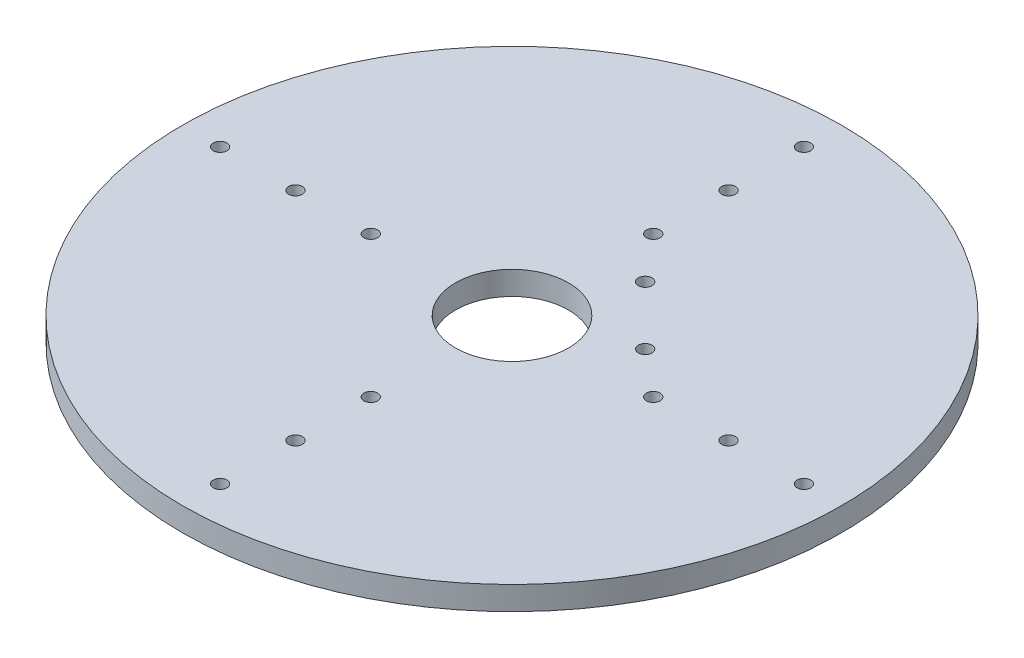
ISO-10303-21;
HEADER;
FILE_DESCRIPTION(('STEP AP214'),'2;1');
FILE_NAME('part.step','',(''),(''),'','','');
FILE_SCHEMA(('AUTOMOTIVE_DESIGN { 1 0 10303 214 1 1 1 1 }'));
ENDSEC;
DATA;
#1=APPLICATION_CONTEXT('core data for automotive mechanical design processes');
#2=APPLICATION_PROTOCOL_DEFINITION('international standard','automotive_design',2000,#1);
#3=PRODUCT_CONTEXT('',#1,'mechanical');
#4=PRODUCT('Part','Part','',(#3));
#5=PRODUCT_RELATED_PRODUCT_CATEGORY('part','',(#4));
#6=PRODUCT_DEFINITION_FORMATION('','',#4);
#7=PRODUCT_DEFINITION_CONTEXT('part definition',#1,'design');
#8=PRODUCT_DEFINITION('design','',#6,#7);
#9=PRODUCT_DEFINITION_SHAPE('','',#8);
#10=(LENGTH_UNIT() NAMED_UNIT(*) SI_UNIT(.MILLI.,.METRE.));
#11=(NAMED_UNIT(*) PLANE_ANGLE_UNIT() SI_UNIT($,.RADIAN.));
#12=(NAMED_UNIT(*) SI_UNIT($,.STERADIAN.) SOLID_ANGLE_UNIT());
#13=UNCERTAINTY_MEASURE_WITH_UNIT(LENGTH_MEASURE(1.E-05),#10,'distance_accuracy_value','');
#14=(GEOMETRIC_REPRESENTATION_CONTEXT(3) GLOBAL_UNCERTAINTY_ASSIGNED_CONTEXT((#13)) GLOBAL_UNIT_ASSIGNED_CONTEXT((#10,
#11,#12)) REPRESENTATION_CONTEXT('',''));
#15=CARTESIAN_POINT('',(0.,0.,0.));
#16=DIRECTION('',(0.,0.,1.));
#17=DIRECTION('',(1.,0.,0.));
#18=AXIS2_PLACEMENT_3D('',#15,#16,#17);
#19=CARTESIAN_POINT('',(0.,2.5,0.));
#20=DIRECTION('',(0.,1.,0.));
#21=DIRECTION('',(0.,0.,1.));
#22=AXIS2_PLACEMENT_3D('',#19,#20,#21);
#23=PLANE('',#22);
#24=CARTESIAN_POINT('',(0.,2.5,46.0000000000003));
#25=DIRECTION('',(0.,1.,0.));
#26=DIRECTION('',(0.,0.,1.));
#27=AXIS2_PLACEMENT_3D('',#24,#25,#26);
#28=CIRCLE('',#27,1.44999999999995);
#29=CARTESIAN_POINT('',(0.,2.5,47.4500000000002));
#30=VERTEX_POINT('',#29);
#31=EDGE_CURVE('E120',#30,#30,#28,.T.);
#32=ORIENTED_EDGE('',*,*,#31,.F.);
#33=EDGE_LOOP('',(#32));
#34=FACE_BOUND('',#33,.T.);
#35=CARTESIAN_POINT('',(-61.9999999999998,2.5,0.));
#36=DIRECTION('',(0.,1.,0.));
#37=DIRECTION('',(0.,0.,1.));
#38=AXIS2_PLACEMENT_3D('',#35,#36,#37);
#39=CIRCLE('',#38,1.44999999999995);
#40=CARTESIAN_POINT('',(-61.9999999999998,2.5,1.44999999999995));
#41=VERTEX_POINT('',#40);
#42=EDGE_CURVE('E108',#41,#41,#39,.T.);
#43=ORIENTED_EDGE('',*,*,#42,.F.);
#44=EDGE_LOOP('',(#43));
#45=FACE_BOUND('',#44,.T.);
#46=CARTESIAN_POINT('',(-30.,2.5,0.));
#47=DIRECTION('',(0.,1.,0.));
#48=DIRECTION('',(0.,0.,1.));
#49=AXIS2_PLACEMENT_3D('',#46,#47,#48);
#50=CIRCLE('',#49,1.44999999999995);
#51=CARTESIAN_POINT('',(-30.,2.5,1.44999999999995));
#52=VERTEX_POINT('',#51);
#53=EDGE_CURVE('E96',#52,#52,#50,.T.);
#54=ORIENTED_EDGE('',*,*,#53,.F.);
#55=EDGE_LOOP('',(#54));
#56=FACE_BOUND('',#55,.T.);
#57=CARTESIAN_POINT('',(1.11022302462516E-12,2.5,-45.9999999999998));
#58=DIRECTION('',(0.,1.,0.));
#59=DIRECTION('',(0.,0.,1.));
#60=AXIS2_PLACEMENT_3D('',#57,#58,#59);
#61=CIRCLE('',#60,1.44999999999995);
#62=CARTESIAN_POINT('',(1.11022302462516E-12,2.5,-44.5499999999999));
#63=VERTEX_POINT('',#62);
#64=EDGE_CURVE('E84',#63,#63,#61,.T.);
#65=ORIENTED_EDGE('',*,*,#64,.F.);
#66=EDGE_LOOP('',(#65));
#67=FACE_BOUND('',#66,.T.);
#68=CARTESIAN_POINT('',(62.0000000000001,2.5,0.));
#69=DIRECTION('',(0.,1.,0.));
#70=DIRECTION('',(0.,0.,1.));
#71=AXIS2_PLACEMENT_3D('',#68,#69,#70);
#72=CIRCLE('',#71,1.44999999999995);
#73=CARTESIAN_POINT('',(62.0000000000001,2.5,1.44999999999995));
#74=VERTEX_POINT('',#73);
#75=EDGE_CURVE('E72',#74,#74,#72,.T.);
#76=ORIENTED_EDGE('',*,*,#75,.F.);
#77=EDGE_LOOP('',(#76));
#78=FACE_BOUND('',#77,.T.);
#79=CARTESIAN_POINT('',(30.,2.5,0.));
#80=DIRECTION('',(0.,1.,0.));
#81=DIRECTION('',(0.,0.,1.));
#82=AXIS2_PLACEMENT_3D('',#79,#80,#81);
#83=CIRCLE('',#82,1.44999999999995);
#84=CARTESIAN_POINT('',(30.,2.5,1.44999999999995));
#85=VERTEX_POINT('',#84);
#86=EDGE_CURVE('E60',#85,#85,#83,.T.);
#87=ORIENTED_EDGE('',*,*,#86,.F.);
#88=EDGE_LOOP('',(#87));
#89=FACE_BOUND('',#88,.T.);
#90=CARTESIAN_POINT('',(20.329319959113,2.5,-7.95495128834922));
#91=DIRECTION('',(0.,1.,0.));
#92=DIRECTION('',(0.,0.,1.));
#93=AXIS2_PLACEMENT_3D('',#90,#91,#92);
#94=CIRCLE('',#93,1.44999999999995);
#95=CARTESIAN_POINT('',(20.329319959113,2.5,-6.50495128834927));
#96=VERTEX_POINT('',#95);
#97=EDGE_CURVE('E48',#96,#96,#94,.T.);
#98=ORIENTED_EDGE('',*,*,#97,.F.);
#99=EDGE_LOOP('',(#98));
#100=FACE_BOUND('',#99,.T.);
#101=CARTESIAN_POINT('',(0.,2.5,0.));
#102=DIRECTION('',(0.,1.,0.));
#103=DIRECTION('',(0.,0.,1.));
#104=AXIS2_PLACEMENT_3D('',#101,#102,#103);
#105=CIRCLE('',#104,70.0000000000001);
#106=CARTESIAN_POINT('',(0.,2.5,70.0000000000001));
#107=VERTEX_POINT('',#106);
#108=EDGE_CURVE('E10',#107,#107,#105,.T.);
#109=ORIENTED_EDGE('',*,*,#108,.T.);
#110=EDGE_LOOP('',(#109));
#111=FACE_BOUND('',#110,.T.);
#112=CARTESIAN_POINT('',(7.954951288349,2.5,-20.3293199591119));
#113=DIRECTION('',(0.,1.,0.));
#114=DIRECTION('',(0.,0.,1.));
#115=AXIS2_PLACEMENT_3D('',#112,#113,#114);
#116=CIRCLE('',#115,1.44999999999995);
#117=CARTESIAN_POINT('',(7.954951288349,2.5,-18.879319959112));
#118=VERTEX_POINT('',#117);
#119=EDGE_CURVE('E43',#118,#118,#116,.T.);
#120=ORIENTED_EDGE('',*,*,#119,.F.);
#121=EDGE_LOOP('',(#120));
#122=FACE_BOUND('',#121,.T.);
#123=CARTESIAN_POINT('',(0.,2.5,0.));
#124=DIRECTION('',(0.,1.,0.));
#125=DIRECTION('',(0.,0.,1.));
#126=AXIS2_PLACEMENT_3D('',#123,#124,#125);
#127=CIRCLE('',#126,12.);
#128=CARTESIAN_POINT('',(0.,2.5,12.));
#129=VERTEX_POINT('',#128);
#130=EDGE_CURVE('E54',#129,#129,#127,.T.);
#131=ORIENTED_EDGE('',*,*,#130,.F.);
#132=EDGE_LOOP('',(#131));
#133=FACE_BOUND('',#132,.T.);
#134=CARTESIAN_POINT('',(46.,2.5,0.));
#135=DIRECTION('',(0.,1.,0.));
#136=DIRECTION('',(0.,0.,1.));
#137=AXIS2_PLACEMENT_3D('',#134,#135,#136);
#138=CIRCLE('',#137,1.44999999999995);
#139=CARTESIAN_POINT('',(46.,2.5,1.44999999999995));
#140=VERTEX_POINT('',#139);
#141=EDGE_CURVE('E66',#140,#140,#138,.T.);
#142=ORIENTED_EDGE('',*,*,#141,.F.);
#143=EDGE_LOOP('',(#142));
#144=FACE_BOUND('',#143,.T.);
#145=CARTESIAN_POINT('',(1.11022302462516E-12,2.5,-29.9999999999998));
#146=DIRECTION('',(0.,1.,0.));
#147=DIRECTION('',(0.,0.,1.));
#148=AXIS2_PLACEMENT_3D('',#145,#146,#147);
#149=CIRCLE('',#148,1.44999999999995);
#150=CARTESIAN_POINT('',(1.11022302462516E-12,2.5,-28.5499999999999));
#151=VERTEX_POINT('',#150);
#152=EDGE_CURVE('E78',#151,#151,#149,.T.);
#153=ORIENTED_EDGE('',*,*,#152,.F.);
#154=EDGE_LOOP('',(#153));
#155=FACE_BOUND('',#154,.T.);
#156=CARTESIAN_POINT('',(1.11022302462516E-12,2.5,-61.9999999999998));
#157=DIRECTION('',(0.,1.,0.));
#158=DIRECTION('',(0.,0.,1.));
#159=AXIS2_PLACEMENT_3D('',#156,#157,#158);
#160=CIRCLE('',#159,1.44999999999995);
#161=CARTESIAN_POINT('',(1.11022302462516E-12,2.5,-60.5499999999999));
#162=VERTEX_POINT('',#161);
#163=EDGE_CURVE('E90',#162,#162,#160,.T.);
#164=ORIENTED_EDGE('',*,*,#163,.F.);
#165=EDGE_LOOP('',(#164));
#166=FACE_BOUND('',#165,.T.);
#167=CARTESIAN_POINT('',(-46.,2.5,0.));
#168=DIRECTION('',(0.,1.,0.));
#169=DIRECTION('',(0.,0.,1.));
#170=AXIS2_PLACEMENT_3D('',#167,#168,#169);
#171=CIRCLE('',#170,1.44999999999995);
#172=CARTESIAN_POINT('',(-46.,2.5,1.44999999999995));
#173=VERTEX_POINT('',#172);
#174=EDGE_CURVE('E102',#173,#173,#171,.T.);
#175=ORIENTED_EDGE('',*,*,#174,.F.);
#176=EDGE_LOOP('',(#175));
#177=FACE_BOUND('',#176,.T.);
#178=CARTESIAN_POINT('',(0.,2.5,30.0000000000002));
#179=DIRECTION('',(0.,1.,0.));
#180=DIRECTION('',(0.,0.,1.));
#181=AXIS2_PLACEMENT_3D('',#178,#179,#180);
#182=CIRCLE('',#181,1.44999999999995);
#183=CARTESIAN_POINT('',(0.,2.5,31.4500000000002));
#184=VERTEX_POINT('',#183);
#185=EDGE_CURVE('E114',#184,#184,#182,.T.);
#186=ORIENTED_EDGE('',*,*,#185,.F.);
#187=EDGE_LOOP('',(#186));
#188=FACE_BOUND('',#187,.T.);
#189=CARTESIAN_POINT('',(0.,2.5,62.0000000000002));
#190=DIRECTION('',(0.,1.,0.));
#191=DIRECTION('',(0.,0.,1.));
#192=AXIS2_PLACEMENT_3D('',#189,#190,#191);
#193=CIRCLE('',#192,1.44999999999995);
#194=CARTESIAN_POINT('',(0.,2.5,63.4500000000002));
#195=VERTEX_POINT('',#194);
#196=EDGE_CURVE('E126',#195,#195,#193,.T.);
#197=ORIENTED_EDGE('',*,*,#196,.F.);
#198=EDGE_LOOP('',(#197));
#199=FACE_BOUND('',#198,.T.);
#200=ADVANCED_FACE('F32',(#34,#45,#56,#67,#78,#89,#100,#111,#122,#133,#144,#155,#166,#177,#188,
#199),#23,.T.);
#201=CARTESIAN_POINT('',(0.,-2.5,0.));
#202=DIRECTION('',(0.,1.,0.));
#203=DIRECTION('',(0.,0.,1.));
#204=AXIS2_PLACEMENT_3D('',#201,#202,#203);
#205=PLANE('',#204);
#206=CARTESIAN_POINT('',(0.,-2.5,0.));
#207=DIRECTION('',(0.,1.,0.));
#208=DIRECTION('',(0.,0.,1.));
#209=AXIS2_PLACEMENT_3D('',#206,#207,#208);
#210=CIRCLE('',#209,70.0000000000001);
#211=CARTESIAN_POINT('',(0.,-2.5,70.0000000000001));
#212=VERTEX_POINT('',#211);
#213=EDGE_CURVE('E36',#212,#212,#210,.T.);
#214=ORIENTED_EDGE('',*,*,#213,.F.);
#215=EDGE_LOOP('',(#214));
#216=FACE_BOUND('',#215,.T.);
#217=CARTESIAN_POINT('',(7.954951288349,-2.5,-20.3293199591119));
#218=DIRECTION('',(0.,1.,0.));
#219=DIRECTION('',(0.,0.,1.));
#220=AXIS2_PLACEMENT_3D('',#217,#218,#219);
#221=CIRCLE('',#220,1.44999999999995);
#222=CARTESIAN_POINT('',(7.954951288349,-2.5,-18.879319959112));
#223=VERTEX_POINT('',#222);
#224=EDGE_CURVE('E45',#223,#223,#221,.T.);
#225=ORIENTED_EDGE('',*,*,#224,.T.);
#226=EDGE_LOOP('',(#225));
#227=FACE_BOUND('',#226,.T.);
#228=CARTESIAN_POINT('',(20.329319959113,-2.5,-7.95495128834922));
#229=DIRECTION('',(0.,1.,0.));
#230=DIRECTION('',(0.,0.,1.));
#231=AXIS2_PLACEMENT_3D('',#228,#229,#230);
#232=CIRCLE('',#231,1.44999999999995);
#233=CARTESIAN_POINT('',(20.329319959113,-2.5,-6.50495128834927));
#234=VERTEX_POINT('',#233);
#235=EDGE_CURVE('E51',#234,#234,#232,.T.);
#236=ORIENTED_EDGE('',*,*,#235,.T.);
#237=EDGE_LOOP('',(#236));
#238=FACE_BOUND('',#237,.T.);
#239=CARTESIAN_POINT('',(0.,-2.5,0.));
#240=DIRECTION('',(0.,1.,0.));
#241=DIRECTION('',(0.,0.,1.));
#242=AXIS2_PLACEMENT_3D('',#239,#240,#241);
#243=CIRCLE('',#242,12.);
#244=CARTESIAN_POINT('',(0.,-2.5,12.));
#245=VERTEX_POINT('',#244);
#246=EDGE_CURVE('E57',#245,#245,#243,.T.);
#247=ORIENTED_EDGE('',*,*,#246,.T.);
#248=EDGE_LOOP('',(#247));
#249=FACE_BOUND('',#248,.T.);
#250=CARTESIAN_POINT('',(30.,-2.5,0.));
#251=DIRECTION('',(0.,1.,0.));
#252=DIRECTION('',(0.,0.,1.));
#253=AXIS2_PLACEMENT_3D('',#250,#251,#252);
#254=CIRCLE('',#253,1.44999999999995);
#255=CARTESIAN_POINT('',(30.,-2.5,1.44999999999995));
#256=VERTEX_POINT('',#255);
#257=EDGE_CURVE('E63',#256,#256,#254,.T.);
#258=ORIENTED_EDGE('',*,*,#257,.T.);
#259=EDGE_LOOP('',(#258));
#260=FACE_BOUND('',#259,.T.);
#261=CARTESIAN_POINT('',(46.,-2.5,0.));
#262=DIRECTION('',(0.,1.,0.));
#263=DIRECTION('',(0.,0.,1.));
#264=AXIS2_PLACEMENT_3D('',#261,#262,#263);
#265=CIRCLE('',#264,1.44999999999995);
#266=CARTESIAN_POINT('',(46.,-2.5,1.44999999999995));
#267=VERTEX_POINT('',#266);
#268=EDGE_CURVE('E69',#267,#267,#265,.T.);
#269=ORIENTED_EDGE('',*,*,#268,.T.);
#270=EDGE_LOOP('',(#269));
#271=FACE_BOUND('',#270,.T.);
#272=CARTESIAN_POINT('',(62.0000000000001,-2.5,0.));
#273=DIRECTION('',(0.,1.,0.));
#274=DIRECTION('',(0.,0.,1.));
#275=AXIS2_PLACEMENT_3D('',#272,#273,#274);
#276=CIRCLE('',#275,1.44999999999995);
#277=CARTESIAN_POINT('',(62.0000000000001,-2.5,1.44999999999995));
#278=VERTEX_POINT('',#277);
#279=EDGE_CURVE('E75',#278,#278,#276,.T.);
#280=ORIENTED_EDGE('',*,*,#279,.T.);
#281=EDGE_LOOP('',(#280));
#282=FACE_BOUND('',#281,.T.);
#283=CARTESIAN_POINT('',(1.11022302462516E-12,-2.5,-29.9999999999998));
#284=DIRECTION('',(0.,1.,0.));
#285=DIRECTION('',(0.,0.,1.));
#286=AXIS2_PLACEMENT_3D('',#283,#284,#285);
#287=CIRCLE('',#286,1.44999999999995);
#288=CARTESIAN_POINT('',(1.11022302462516E-12,-2.5,-28.5499999999999));
#289=VERTEX_POINT('',#288);
#290=EDGE_CURVE('E81',#289,#289,#287,.T.);
#291=ORIENTED_EDGE('',*,*,#290,.T.);
#292=EDGE_LOOP('',(#291));
#293=FACE_BOUND('',#292,.T.);
#294=CARTESIAN_POINT('',(1.11022302462516E-12,-2.5,-45.9999999999998));
#295=DIRECTION('',(0.,1.,0.));
#296=DIRECTION('',(0.,0.,1.));
#297=AXIS2_PLACEMENT_3D('',#294,#295,#296);
#298=CIRCLE('',#297,1.44999999999995);
#299=CARTESIAN_POINT('',(1.11022302462516E-12,-2.5,-44.5499999999999));
#300=VERTEX_POINT('',#299);
#301=EDGE_CURVE('E87',#300,#300,#298,.T.);
#302=ORIENTED_EDGE('',*,*,#301,.T.);
#303=EDGE_LOOP('',(#302));
#304=FACE_BOUND('',#303,.T.);
#305=CARTESIAN_POINT('',(1.11022302462516E-12,-2.5,-61.9999999999998));
#306=DIRECTION('',(0.,1.,0.));
#307=DIRECTION('',(0.,0.,1.));
#308=AXIS2_PLACEMENT_3D('',#305,#306,#307);
#309=CIRCLE('',#308,1.44999999999995);
#310=CARTESIAN_POINT('',(1.11022302462516E-12,-2.5,-60.5499999999999));
#311=VERTEX_POINT('',#310);
#312=EDGE_CURVE('E93',#311,#311,#309,.T.);
#313=ORIENTED_EDGE('',*,*,#312,.T.);
#314=EDGE_LOOP('',(#313));
#315=FACE_BOUND('',#314,.T.);
#316=CARTESIAN_POINT('',(-30.,-2.5,0.));
#317=DIRECTION('',(0.,1.,0.));
#318=DIRECTION('',(0.,0.,1.));
#319=AXIS2_PLACEMENT_3D('',#316,#317,#318);
#320=CIRCLE('',#319,1.44999999999995);
#321=CARTESIAN_POINT('',(-30.,-2.5,1.44999999999995));
#322=VERTEX_POINT('',#321);
#323=EDGE_CURVE('E99',#322,#322,#320,.T.);
#324=ORIENTED_EDGE('',*,*,#323,.T.);
#325=EDGE_LOOP('',(#324));
#326=FACE_BOUND('',#325,.T.);
#327=CARTESIAN_POINT('',(-46.,-2.5,0.));
#328=DIRECTION('',(0.,1.,0.));
#329=DIRECTION('',(0.,0.,1.));
#330=AXIS2_PLACEMENT_3D('',#327,#328,#329);
#331=CIRCLE('',#330,1.44999999999995);
#332=CARTESIAN_POINT('',(-46.,-2.5,1.44999999999995));
#333=VERTEX_POINT('',#332);
#334=EDGE_CURVE('E105',#333,#333,#331,.T.);
#335=ORIENTED_EDGE('',*,*,#334,.T.);
#336=EDGE_LOOP('',(#335));
#337=FACE_BOUND('',#336,.T.);
#338=CARTESIAN_POINT('',(-61.9999999999998,-2.5,0.));
#339=DIRECTION('',(0.,1.,0.));
#340=DIRECTION('',(0.,0.,1.));
#341=AXIS2_PLACEMENT_3D('',#338,#339,#340);
#342=CIRCLE('',#341,1.44999999999995);
#343=CARTESIAN_POINT('',(-61.9999999999998,-2.5,1.44999999999995));
#344=VERTEX_POINT('',#343);
#345=EDGE_CURVE('E111',#344,#344,#342,.T.);
#346=ORIENTED_EDGE('',*,*,#345,.T.);
#347=EDGE_LOOP('',(#346));
#348=FACE_BOUND('',#347,.T.);
#349=CARTESIAN_POINT('',(0.,-2.5,30.0000000000002));
#350=DIRECTION('',(0.,1.,0.));
#351=DIRECTION('',(0.,0.,1.));
#352=AXIS2_PLACEMENT_3D('',#349,#350,#351);
#353=CIRCLE('',#352,1.44999999999995);
#354=CARTESIAN_POINT('',(0.,-2.5,31.4500000000002));
#355=VERTEX_POINT('',#354);
#356=EDGE_CURVE('E117',#355,#355,#353,.T.);
#357=ORIENTED_EDGE('',*,*,#356,.T.);
#358=EDGE_LOOP('',(#357));
#359=FACE_BOUND('',#358,.T.);
#360=CARTESIAN_POINT('',(0.,-2.5,46.0000000000003));
#361=DIRECTION('',(0.,1.,0.));
#362=DIRECTION('',(0.,0.,1.));
#363=AXIS2_PLACEMENT_3D('',#360,#361,#362);
#364=CIRCLE('',#363,1.44999999999995);
#365=CARTESIAN_POINT('',(0.,-2.5,47.4500000000002));
#366=VERTEX_POINT('',#365);
#367=EDGE_CURVE('E123',#366,#366,#364,.T.);
#368=ORIENTED_EDGE('',*,*,#367,.T.);
#369=EDGE_LOOP('',(#368));
#370=FACE_BOUND('',#369,.T.);
#371=CARTESIAN_POINT('',(0.,-2.5,62.0000000000002));
#372=DIRECTION('',(0.,1.,0.));
#373=DIRECTION('',(0.,0.,1.));
#374=AXIS2_PLACEMENT_3D('',#371,#372,#373);
#375=CIRCLE('',#374,1.44999999999995);
#376=CARTESIAN_POINT('',(0.,-2.5,63.4500000000002));
#377=VERTEX_POINT('',#376);
#378=EDGE_CURVE('E129',#377,#377,#375,.T.);
#379=ORIENTED_EDGE('',*,*,#378,.T.);
#380=EDGE_LOOP('',(#379));
#381=FACE_BOUND('',#380,.T.);
#382=ADVANCED_FACE('F139',(#216,#227,#238,#249,#260,#271,#282,#293,#304,#315,#326,#337,#348,
#359,#370,#381),#205,.F.);
#383=CARTESIAN_POINT('',(0.,2.5,0.));
#384=DIRECTION('',(0.,-1.,0.));
#385=DIRECTION('',(0.,0.,-1.));
#386=AXIS2_PLACEMENT_3D('',#383,#384,#385);
#387=CYLINDRICAL_SURFACE('',#386,70.0000000000001);
#388=ORIENTED_EDGE('',*,*,#108,.F.);
#389=EDGE_LOOP('',(#388));
#390=FACE_BOUND('',#389,.T.);
#391=ORIENTED_EDGE('',*,*,#213,.T.);
#392=EDGE_LOOP('',(#391));
#393=FACE_BOUND('',#392,.T.);
#394=ADVANCED_FACE('F34',(#390,#393),#387,.T.);
#395=CARTESIAN_POINT('',(7.954951288349,2.5,-20.3293199591119));
#396=DIRECTION('',(0.,-1.,0.));
#397=DIRECTION('',(0.,0.,-1.));
#398=AXIS2_PLACEMENT_3D('',#395,#396,#397);
#399=CYLINDRICAL_SURFACE('',#398,1.44999999999995);
#400=ORIENTED_EDGE('',*,*,#119,.T.);
#401=EDGE_LOOP('',(#400));
#402=FACE_BOUND('',#401,.T.);
#403=ORIENTED_EDGE('',*,*,#224,.F.);
#404=EDGE_LOOP('',(#403));
#405=FACE_BOUND('',#404,.T.);
#406=ADVANCED_FACE('F149',(#402,#405),#399,.F.);
#407=CARTESIAN_POINT('',(20.329319959113,2.5,-7.95495128834922));
#408=DIRECTION('',(0.,-1.,0.));
#409=DIRECTION('',(0.,0.,-1.));
#410=AXIS2_PLACEMENT_3D('',#407,#408,#409);
#411=CYLINDRICAL_SURFACE('',#410,1.44999999999995);
#412=ORIENTED_EDGE('',*,*,#97,.T.);
#413=EDGE_LOOP('',(#412));
#414=FACE_BOUND('',#413,.T.);
#415=ORIENTED_EDGE('',*,*,#235,.F.);
#416=EDGE_LOOP('',(#415));
#417=FACE_BOUND('',#416,.T.);
#418=ADVANCED_FACE('F152',(#414,#417),#411,.F.);
#419=CARTESIAN_POINT('',(0.,2.5,0.));
#420=DIRECTION('',(0.,-1.,0.));
#421=DIRECTION('',(0.,0.,-1.));
#422=AXIS2_PLACEMENT_3D('',#419,#420,#421);
#423=CYLINDRICAL_SURFACE('',#422,12.);
#424=ORIENTED_EDGE('',*,*,#130,.T.);
#425=EDGE_LOOP('',(#424));
#426=FACE_BOUND('',#425,.T.);
#427=ORIENTED_EDGE('',*,*,#246,.F.);
#428=EDGE_LOOP('',(#427));
#429=FACE_BOUND('',#428,.T.);
#430=ADVANCED_FACE('F156',(#426,#429),#423,.F.);
#431=CARTESIAN_POINT('',(30.,2.5,0.));
#432=DIRECTION('',(0.,-1.,0.));
#433=DIRECTION('',(0.,0.,-1.));
#434=AXIS2_PLACEMENT_3D('',#431,#432,#433);
#435=CYLINDRICAL_SURFACE('',#434,1.44999999999995);
#436=ORIENTED_EDGE('',*,*,#86,.T.);
#437=EDGE_LOOP('',(#436));
#438=FACE_BOUND('',#437,.T.);
#439=ORIENTED_EDGE('',*,*,#257,.F.);
#440=EDGE_LOOP('',(#439));
#441=FACE_BOUND('',#440,.T.);
#442=ADVANCED_FACE('F160',(#438,#441),#435,.F.);
#443=CARTESIAN_POINT('',(46.,2.5,0.));
#444=DIRECTION('',(0.,-1.,0.));
#445=DIRECTION('',(0.,0.,-1.));
#446=AXIS2_PLACEMENT_3D('',#443,#444,#445);
#447=CYLINDRICAL_SURFACE('',#446,1.44999999999995);
#448=ORIENTED_EDGE('',*,*,#141,.T.);
#449=EDGE_LOOP('',(#448));
#450=FACE_BOUND('',#449,.T.);
#451=ORIENTED_EDGE('',*,*,#268,.F.);
#452=EDGE_LOOP('',(#451));
#453=FACE_BOUND('',#452,.T.);
#454=ADVANCED_FACE('F164',(#450,#453),#447,.F.);
#455=CARTESIAN_POINT('',(62.0000000000001,2.5,0.));
#456=DIRECTION('',(0.,-1.,0.));
#457=DIRECTION('',(0.,0.,-1.));
#458=AXIS2_PLACEMENT_3D('',#455,#456,#457);
#459=CYLINDRICAL_SURFACE('',#458,1.44999999999995);
#460=ORIENTED_EDGE('',*,*,#75,.T.);
#461=EDGE_LOOP('',(#460));
#462=FACE_BOUND('',#461,.T.);
#463=ORIENTED_EDGE('',*,*,#279,.F.);
#464=EDGE_LOOP('',(#463));
#465=FACE_BOUND('',#464,.T.);
#466=ADVANCED_FACE('F168',(#462,#465),#459,.F.);
#467=CARTESIAN_POINT('',(1.11022302462516E-12,2.5,-29.9999999999998));
#468=DIRECTION('',(0.,-1.,0.));
#469=DIRECTION('',(0.,0.,-1.));
#470=AXIS2_PLACEMENT_3D('',#467,#468,#469);
#471=CYLINDRICAL_SURFACE('',#470,1.44999999999995);
#472=ORIENTED_EDGE('',*,*,#152,.T.);
#473=EDGE_LOOP('',(#472));
#474=FACE_BOUND('',#473,.T.);
#475=ORIENTED_EDGE('',*,*,#290,.F.);
#476=EDGE_LOOP('',(#475));
#477=FACE_BOUND('',#476,.T.);
#478=ADVANCED_FACE('F172',(#474,#477),#471,.F.);
#479=CARTESIAN_POINT('',(1.11022302462516E-12,2.5,-45.9999999999998));
#480=DIRECTION('',(0.,-1.,0.));
#481=DIRECTION('',(0.,0.,-1.));
#482=AXIS2_PLACEMENT_3D('',#479,#480,#481);
#483=CYLINDRICAL_SURFACE('',#482,1.44999999999995);
#484=ORIENTED_EDGE('',*,*,#64,.T.);
#485=EDGE_LOOP('',(#484));
#486=FACE_BOUND('',#485,.T.);
#487=ORIENTED_EDGE('',*,*,#301,.F.);
#488=EDGE_LOOP('',(#487));
#489=FACE_BOUND('',#488,.T.);
#490=ADVANCED_FACE('F176',(#486,#489),#483,.F.);
#491=CARTESIAN_POINT('',(1.11022302462516E-12,2.5,-61.9999999999998));
#492=DIRECTION('',(0.,-1.,0.));
#493=DIRECTION('',(0.,0.,-1.));
#494=AXIS2_PLACEMENT_3D('',#491,#492,#493);
#495=CYLINDRICAL_SURFACE('',#494,1.44999999999995);
#496=ORIENTED_EDGE('',*,*,#163,.T.);
#497=EDGE_LOOP('',(#496));
#498=FACE_BOUND('',#497,.T.);
#499=ORIENTED_EDGE('',*,*,#312,.F.);
#500=EDGE_LOOP('',(#499));
#501=FACE_BOUND('',#500,.T.);
#502=ADVANCED_FACE('F180',(#498,#501),#495,.F.);
#503=CARTESIAN_POINT('',(-30.,2.5,0.));
#504=DIRECTION('',(0.,-1.,0.));
#505=DIRECTION('',(0.,0.,-1.));
#506=AXIS2_PLACEMENT_3D('',#503,#504,#505);
#507=CYLINDRICAL_SURFACE('',#506,1.44999999999995);
#508=ORIENTED_EDGE('',*,*,#53,.T.);
#509=EDGE_LOOP('',(#508));
#510=FACE_BOUND('',#509,.T.);
#511=ORIENTED_EDGE('',*,*,#323,.F.);
#512=EDGE_LOOP('',(#511));
#513=FACE_BOUND('',#512,.T.);
#514=ADVANCED_FACE('F184',(#510,#513),#507,.F.);
#515=CARTESIAN_POINT('',(-46.,2.5,0.));
#516=DIRECTION('',(0.,-1.,0.));
#517=DIRECTION('',(0.,0.,-1.));
#518=AXIS2_PLACEMENT_3D('',#515,#516,#517);
#519=CYLINDRICAL_SURFACE('',#518,1.44999999999995);
#520=ORIENTED_EDGE('',*,*,#174,.T.);
#521=EDGE_LOOP('',(#520));
#522=FACE_BOUND('',#521,.T.);
#523=ORIENTED_EDGE('',*,*,#334,.F.);
#524=EDGE_LOOP('',(#523));
#525=FACE_BOUND('',#524,.T.);
#526=ADVANCED_FACE('F188',(#522,#525),#519,.F.);
#527=CARTESIAN_POINT('',(-61.9999999999998,2.5,0.));
#528=DIRECTION('',(0.,-1.,0.));
#529=DIRECTION('',(0.,0.,-1.));
#530=AXIS2_PLACEMENT_3D('',#527,#528,#529);
#531=CYLINDRICAL_SURFACE('',#530,1.44999999999995);
#532=ORIENTED_EDGE('',*,*,#42,.T.);
#533=EDGE_LOOP('',(#532));
#534=FACE_BOUND('',#533,.T.);
#535=ORIENTED_EDGE('',*,*,#345,.F.);
#536=EDGE_LOOP('',(#535));
#537=FACE_BOUND('',#536,.T.);
#538=ADVANCED_FACE('F192',(#534,#537),#531,.F.);
#539=CARTESIAN_POINT('',(0.,2.5,30.0000000000002));
#540=DIRECTION('',(0.,-1.,0.));
#541=DIRECTION('',(0.,0.,-1.));
#542=AXIS2_PLACEMENT_3D('',#539,#540,#541);
#543=CYLINDRICAL_SURFACE('',#542,1.44999999999995);
#544=ORIENTED_EDGE('',*,*,#185,.T.);
#545=EDGE_LOOP('',(#544));
#546=FACE_BOUND('',#545,.T.);
#547=ORIENTED_EDGE('',*,*,#356,.F.);
#548=EDGE_LOOP('',(#547));
#549=FACE_BOUND('',#548,.T.);
#550=ADVANCED_FACE('F196',(#546,#549),#543,.F.);
#551=CARTESIAN_POINT('',(0.,2.5,46.0000000000003));
#552=DIRECTION('',(0.,-1.,0.));
#553=DIRECTION('',(0.,0.,-1.));
#554=AXIS2_PLACEMENT_3D('',#551,#552,#553);
#555=CYLINDRICAL_SURFACE('',#554,1.44999999999995);
#556=ORIENTED_EDGE('',*,*,#31,.T.);
#557=EDGE_LOOP('',(#556));
#558=FACE_BOUND('',#557,.T.);
#559=ORIENTED_EDGE('',*,*,#367,.F.);
#560=EDGE_LOOP('',(#559));
#561=FACE_BOUND('',#560,.T.);
#562=ADVANCED_FACE('F200',(#558,#561),#555,.F.);
#563=CARTESIAN_POINT('',(0.,2.5,62.0000000000002));
#564=DIRECTION('',(0.,-1.,0.));
#565=DIRECTION('',(0.,0.,-1.));
#566=AXIS2_PLACEMENT_3D('',#563,#564,#565);
#567=CYLINDRICAL_SURFACE('',#566,1.44999999999995);
#568=ORIENTED_EDGE('',*,*,#196,.T.);
#569=EDGE_LOOP('',(#568));
#570=FACE_BOUND('',#569,.T.);
#571=ORIENTED_EDGE('',*,*,#378,.F.);
#572=EDGE_LOOP('',(#571));
#573=FACE_BOUND('',#572,.T.);
#574=ADVANCED_FACE('F135',(#570,#573),#567,.F.);
#575=CLOSED_SHELL('',(#200,#382,#394,#406,#418,#430,#442,#454,#466,#478,#490,#502,#514,#526,
#538,#550,#562,#574));
#576=MANIFOLD_SOLID_BREP('B2',#575);
#577=ADVANCED_BREP_SHAPE_REPRESENTATION('',(#18,#576),#14);
#578=SHAPE_DEFINITION_REPRESENTATION(#9,#577);
ENDSEC;
END-ISO-10303-21;
